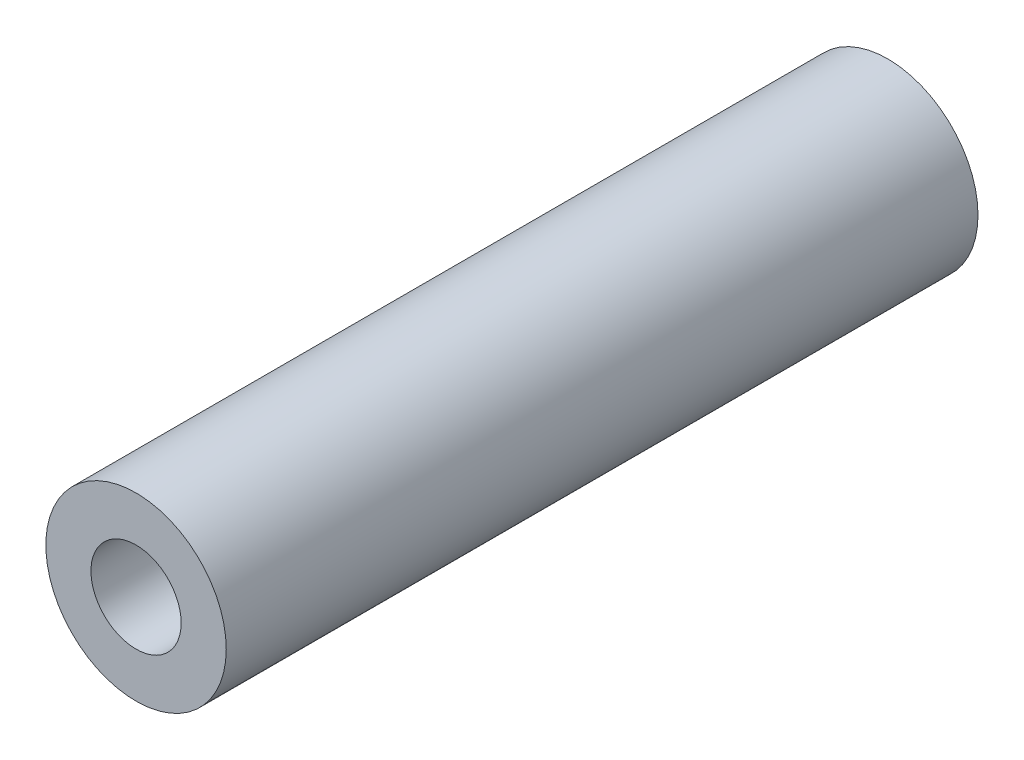
ISO-10303-21;
HEADER;
FILE_DESCRIPTION(('STEP AP214'),'2;1');
FILE_NAME('part.step','',(''),(''),'','','');
FILE_SCHEMA(('AUTOMOTIVE_DESIGN { 1 0 10303 214 1 1 1 1 }'));
ENDSEC;
DATA;
#1=APPLICATION_CONTEXT('core data for automotive mechanical design processes');
#2=APPLICATION_PROTOCOL_DEFINITION('international standard','automotive_design',2000,#1);
#3=PRODUCT_CONTEXT('',#1,'mechanical');
#4=PRODUCT('Part','Part','',(#3));
#5=PRODUCT_RELATED_PRODUCT_CATEGORY('part','',(#4));
#6=PRODUCT_DEFINITION_FORMATION('','',#4);
#7=PRODUCT_DEFINITION_CONTEXT('part definition',#1,'design');
#8=PRODUCT_DEFINITION('design','',#6,#7);
#9=PRODUCT_DEFINITION_SHAPE('','',#8);
#10=(LENGTH_UNIT() NAMED_UNIT(*) SI_UNIT(.MILLI.,.METRE.));
#11=(NAMED_UNIT(*) PLANE_ANGLE_UNIT() SI_UNIT($,.RADIAN.));
#12=(NAMED_UNIT(*) SI_UNIT($,.STERADIAN.) SOLID_ANGLE_UNIT());
#13=UNCERTAINTY_MEASURE_WITH_UNIT(LENGTH_MEASURE(1.E-05),#10,'distance_accuracy_value','');
#14=(GEOMETRIC_REPRESENTATION_CONTEXT(3) GLOBAL_UNCERTAINTY_ASSIGNED_CONTEXT((#13)) GLOBAL_UNIT_ASSIGNED_CONTEXT((#10,
#11,#12)) REPRESENTATION_CONTEXT('',''));
#15=CARTESIAN_POINT('',(0.,0.,0.));
#16=DIRECTION('',(0.,0.,1.));
#17=DIRECTION('',(1.,0.,0.));
#18=AXIS2_PLACEMENT_3D('',#15,#16,#17);
#19=CARTESIAN_POINT('',(0.,0.,25.));
#20=DIRECTION('',(0.,0.,1.));
#21=DIRECTION('',(1.,0.,0.));
#22=AXIS2_PLACEMENT_3D('',#19,#20,#21);
#23=PLANE('',#22);
#24=CARTESIAN_POINT('',(0.,0.,25.));
#25=DIRECTION('',(0.,0.,1.));
#26=DIRECTION('',(1.,0.,0.));
#27=AXIS2_PLACEMENT_3D('',#24,#25,#26);
#28=CIRCLE('',#27,3.);
#29=CARTESIAN_POINT('',(3.,0.,25.));
#30=VERTEX_POINT('',#29);
#31=EDGE_CURVE('E10',#30,#30,#28,.T.);
#32=ORIENTED_EDGE('',*,*,#31,.T.);
#33=EDGE_LOOP('',(#32));
#34=FACE_BOUND('',#33,.T.);
#35=CARTESIAN_POINT('',(0.,0.,25.));
#36=DIRECTION('',(0.,0.,1.));
#37=DIRECTION('',(1.,0.,0.));
#38=AXIS2_PLACEMENT_3D('',#35,#36,#37);
#39=CIRCLE('',#38,1.5);
#40=CARTESIAN_POINT('',(1.5,0.,25.));
#41=VERTEX_POINT('',#40);
#42=EDGE_CURVE('E43',#41,#41,#39,.T.);
#43=ORIENTED_EDGE('',*,*,#42,.F.);
#44=EDGE_LOOP('',(#43));
#45=FACE_BOUND('',#44,.T.);
#46=ADVANCED_FACE('F32',(#34,#45),#23,.T.);
#47=CARTESIAN_POINT('',(0.,0.,0.));
#48=DIRECTION('',(0.,0.,1.));
#49=DIRECTION('',(1.,0.,0.));
#50=AXIS2_PLACEMENT_3D('',#47,#48,#49);
#51=PLANE('',#50);
#52=CARTESIAN_POINT('',(0.,0.,0.));
#53=DIRECTION('',(0.,0.,1.));
#54=DIRECTION('',(1.,0.,0.));
#55=AXIS2_PLACEMENT_3D('',#52,#53,#54);
#56=CIRCLE('',#55,3.);
#57=CARTESIAN_POINT('',(3.,0.,0.));
#58=VERTEX_POINT('',#57);
#59=EDGE_CURVE('E36',#58,#58,#56,.T.);
#60=ORIENTED_EDGE('',*,*,#59,.F.);
#61=EDGE_LOOP('',(#60));
#62=FACE_BOUND('',#61,.T.);
#63=CARTESIAN_POINT('',(0.,0.,0.));
#64=DIRECTION('',(0.,0.,1.));
#65=DIRECTION('',(1.,0.,0.));
#66=AXIS2_PLACEMENT_3D('',#63,#64,#65);
#67=CIRCLE('',#66,1.5);
#68=CARTESIAN_POINT('',(1.5,0.,0.));
#69=VERTEX_POINT('',#68);
#70=EDGE_CURVE('E45',#69,#69,#67,.T.);
#71=ORIENTED_EDGE('',*,*,#70,.T.);
#72=EDGE_LOOP('',(#71));
#73=FACE_BOUND('',#72,.T.);
#74=ADVANCED_FACE('F55',(#62,#73),#51,.F.);
#75=CARTESIAN_POINT('',(0.,0.,25.));
#76=DIRECTION('',(0.,0.,-1.));
#77=DIRECTION('',(-1.,0.,0.));
#78=AXIS2_PLACEMENT_3D('',#75,#76,#77);
#79=CYLINDRICAL_SURFACE('',#78,3.);
#80=ORIENTED_EDGE('',*,*,#31,.F.);
#81=EDGE_LOOP('',(#80));
#82=FACE_BOUND('',#81,.T.);
#83=ORIENTED_EDGE('',*,*,#59,.T.);
#84=EDGE_LOOP('',(#83));
#85=FACE_BOUND('',#84,.T.);
#86=ADVANCED_FACE('F34',(#82,#85),#79,.T.);
#87=CARTESIAN_POINT('',(0.,0.,25.));
#88=DIRECTION('',(0.,0.,-1.));
#89=DIRECTION('',(-1.,0.,0.));
#90=AXIS2_PLACEMENT_3D('',#87,#88,#89);
#91=CYLINDRICAL_SURFACE('',#90,1.5);
#92=ORIENTED_EDGE('',*,*,#42,.T.);
#93=EDGE_LOOP('',(#92));
#94=FACE_BOUND('',#93,.T.);
#95=ORIENTED_EDGE('',*,*,#70,.F.);
#96=EDGE_LOOP('',(#95));
#97=FACE_BOUND('',#96,.T.);
#98=ADVANCED_FACE('F51',(#94,#97),#91,.F.);
#99=CLOSED_SHELL('',(#46,#74,#86,#98));
#100=MANIFOLD_SOLID_BREP('B2',#99);
#101=ADVANCED_BREP_SHAPE_REPRESENTATION('',(#18,#100),#14);
#102=SHAPE_DEFINITION_REPRESENTATION(#9,#101);
ENDSEC;
END-ISO-10303-21;
